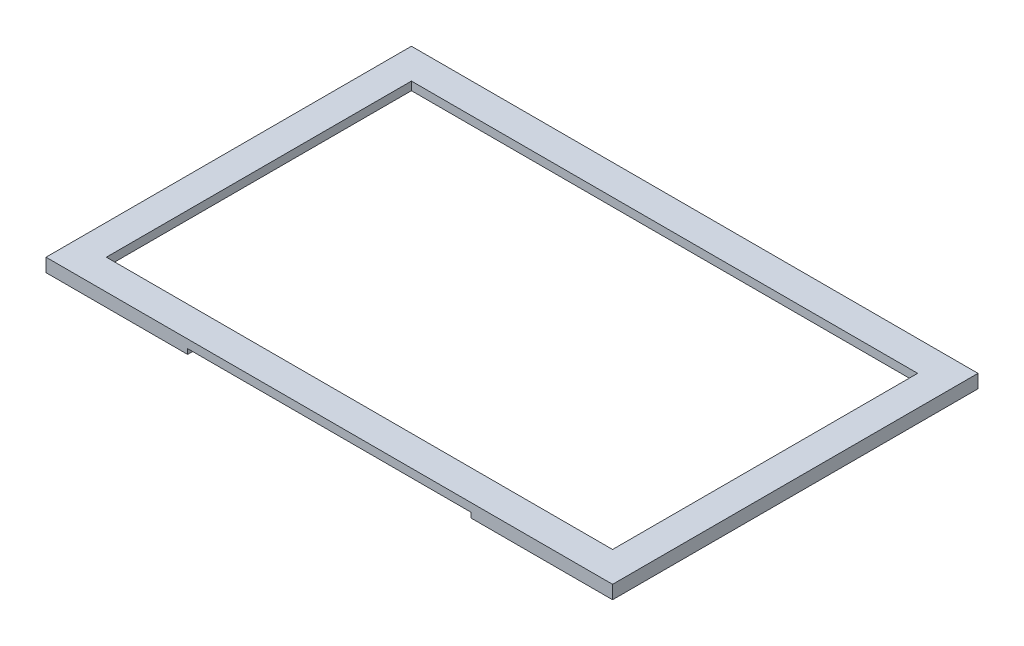
ISO-10303-21;
HEADER;
FILE_DESCRIPTION(('STEP AP214'),'2;1');
FILE_NAME('part.step','',(''),(''),'','','');
FILE_SCHEMA(('AUTOMOTIVE_DESIGN { 1 0 10303 214 1 1 1 1 }'));
ENDSEC;
DATA;
#1=APPLICATION_CONTEXT('core data for automotive mechanical design processes');
#2=APPLICATION_PROTOCOL_DEFINITION('international standard','automotive_design',2000,#1);
#3=PRODUCT_CONTEXT('',#1,'mechanical');
#4=PRODUCT('Part','Part','',(#3));
#5=PRODUCT_RELATED_PRODUCT_CATEGORY('part','',(#4));
#6=PRODUCT_DEFINITION_FORMATION('','',#4);
#7=PRODUCT_DEFINITION_CONTEXT('part definition',#1,'design');
#8=PRODUCT_DEFINITION('design','',#6,#7);
#9=PRODUCT_DEFINITION_SHAPE('','',#8);
#10=(LENGTH_UNIT() NAMED_UNIT(*) SI_UNIT(.MILLI.,.METRE.));
#11=(NAMED_UNIT(*) PLANE_ANGLE_UNIT() SI_UNIT($,.RADIAN.));
#12=(NAMED_UNIT(*) SI_UNIT($,.STERADIAN.) SOLID_ANGLE_UNIT());
#13=UNCERTAINTY_MEASURE_WITH_UNIT(LENGTH_MEASURE(1.E-05),#10,'distance_accuracy_value','');
#14=(GEOMETRIC_REPRESENTATION_CONTEXT(3) GLOBAL_UNCERTAINTY_ASSIGNED_CONTEXT((#13)) GLOBAL_UNIT_ASSIGNED_CONTEXT((#10,
#11,#12)) REPRESENTATION_CONTEXT('',''));
#15=CARTESIAN_POINT('',(0.,0.,0.));
#16=DIRECTION('',(0.,0.,1.));
#17=DIRECTION('',(1.,0.,0.));
#18=AXIS2_PLACEMENT_3D('',#15,#16,#17);
#19=CARTESIAN_POINT('',(167.,1.5,-1.99999999999999));
#20=DIRECTION('',(0.,0.,1.));
#21=DIRECTION('',(1.,0.,0.));
#22=AXIS2_PLACEMENT_3D('',#19,#20,#21);
#23=PLANE('',#22);
#24=DIRECTION('',(-1.,0.,0.));
#25=VECTOR('',#24,1.);
#26=CARTESIAN_POINT('',(167.,1.5,-1.99999999999999));
#27=LINE('',#26,#25);
#28=CARTESIAN_POINT('',(42.25,1.5,-2.));
#29=VERTEX_POINT('',#28);
#30=CARTESIAN_POINT('',(1.99999999999999,1.5,-2.00000000000001));
#31=VERTEX_POINT('',#30);
#32=EDGE_CURVE('E168',#29,#31,#27,.T.);
#33=ORIENTED_EDGE('',*,*,#32,.F.);
#34=DIRECTION('',(0.,-1.,0.));
#35=VECTOR('',#34,1.);
#36=CARTESIAN_POINT('',(42.25,0.,-2.));
#37=LINE('',#36,#35);
#38=CARTESIAN_POINT('',(42.25,0.,-2.));
#39=VERTEX_POINT('',#38);
#40=EDGE_CURVE('E55',#29,#39,#37,.T.);
#41=ORIENTED_EDGE('',*,*,#40,.T.);
#42=DIRECTION('',(-1.,0.,0.));
#43=VECTOR('',#42,1.);
#44=CARTESIAN_POINT('',(167.,0.,-1.99999999999999));
#45=LINE('',#44,#43);
#46=CARTESIAN_POINT('',(1.99999999999999,0.,-2.00000000000001));
#47=VERTEX_POINT('',#46);
#48=EDGE_CURVE('E166',#39,#47,#45,.T.);
#49=ORIENTED_EDGE('',*,*,#48,.T.);
#50=DIRECTION('',(0.,-1.,0.));
#51=VECTOR('',#50,1.);
#52=CARTESIAN_POINT('',(1.99999999999999,1.5,-2.00000000000001));
#53=LINE('',#52,#51);
#54=EDGE_CURVE('E189',#31,#47,#53,.T.);
#55=ORIENTED_EDGE('',*,*,#54,.F.);
#56=EDGE_LOOP('',(#33,#41,#49,#55));
#57=FACE_BOUND('',#56,.T.);
#58=ADVANCED_FACE('F39',(#57),#23,.F.);
#59=CARTESIAN_POINT('',(0.,0.,-109.));
#60=DIRECTION('',(-1.,0.,0.));
#61=DIRECTION('',(0.,0.,1.));
#62=AXIS2_PLACEMENT_3D('',#59,#60,#61);
#63=PLANE('',#62);
#64=DIRECTION('',(0.,-1.,0.));
#65=VECTOR('',#64,1.);
#66=CARTESIAN_POINT('',(0.,0.,0.));
#67=LINE('',#66,#65);
#68=CARTESIAN_POINT('',(0.,4.,0.));
#69=VERTEX_POINT('',#68);
#70=CARTESIAN_POINT('',(0.,0.,0.));
#71=VERTEX_POINT('',#70);
#72=EDGE_CURVE('E192',#69,#71,#67,.T.);
#73=ORIENTED_EDGE('',*,*,#72,.F.);
#74=DIRECTION('',(0.,0.,1.));
#75=VECTOR('',#74,1.);
#76=CARTESIAN_POINT('',(0.,4.,-109.));
#77=LINE('',#76,#75);
#78=CARTESIAN_POINT('',(0.,4.,-109.));
#79=VERTEX_POINT('',#78);
#80=EDGE_CURVE('E236',#79,#69,#77,.T.);
#81=ORIENTED_EDGE('',*,*,#80,.F.);
#82=DIRECTION('',(0.,-1.,0.));
#83=VECTOR('',#82,1.);
#84=CARTESIAN_POINT('',(0.,0.,-109.));
#85=LINE('',#84,#83);
#86=CARTESIAN_POINT('',(0.,0.,-109.));
#87=VERTEX_POINT('',#86);
#88=EDGE_CURVE('E204',#79,#87,#85,.T.);
#89=ORIENTED_EDGE('',*,*,#88,.T.);
#90=DIRECTION('',(0.,0.,1.));
#91=VECTOR('',#90,1.);
#92=CARTESIAN_POINT('',(0.,0.,-109.));
#93=LINE('',#92,#91);
#94=EDGE_CURVE('E221',#87,#71,#93,.T.);
#95=ORIENTED_EDGE('',*,*,#94,.T.);
#96=EDGE_LOOP('',(#73,#81,#89,#95));
#97=FACE_BOUND('',#96,.T.);
#98=ADVANCED_FACE('F41',(#97),#63,.T.);
#99=CARTESIAN_POINT('',(0.,4.,-109.));
#100=DIRECTION('',(0.,1.,0.));
#101=DIRECTION('',(0.,0.,1.));
#102=AXIS2_PLACEMENT_3D('',#99,#100,#101);
#103=PLANE('',#102);
#104=DIRECTION('',(0.,0.,1.));
#105=VECTOR('',#104,1.);
#106=CARTESIAN_POINT('',(9.00000000000001,4.,-9.));
#107=LINE('',#106,#105);
#108=CARTESIAN_POINT('',(9.00000000000001,4.,-100.));
#109=VERTEX_POINT('',#108);
#110=CARTESIAN_POINT('',(9.00000000000001,4.,-9.00000000000001));
#111=VERTEX_POINT('',#110);
#112=EDGE_CURVE('E63',#109,#111,#107,.T.);
#113=ORIENTED_EDGE('',*,*,#112,.F.);
#114=DIRECTION('',(-1.,0.,0.));
#115=VECTOR('',#114,1.);
#116=CARTESIAN_POINT('',(160.,4.,-100.));
#117=LINE('',#116,#115);
#118=CARTESIAN_POINT('',(160.,4.,-100.));
#119=VERTEX_POINT('',#118);
#120=EDGE_CURVE('E285',#119,#109,#117,.T.);
#121=ORIENTED_EDGE('',*,*,#120,.F.);
#122=DIRECTION('',(0.,0.,-1.));
#123=VECTOR('',#122,1.);
#124=CARTESIAN_POINT('',(160.,4.,-9.00000000000002));
#125=LINE('',#124,#123);
#126=CARTESIAN_POINT('',(160.,4.,-9.00000000000002));
#127=VERTEX_POINT('',#126);
#128=EDGE_CURVE('E271',#127,#119,#125,.T.);
#129=ORIENTED_EDGE('',*,*,#128,.F.);
#130=DIRECTION('',(1.,0.,0.));
#131=VECTOR('',#130,1.);
#132=CARTESIAN_POINT('',(160.,4.,-9.00000000000002));
#133=LINE('',#132,#131);
#134=EDGE_CURVE('E393',#111,#127,#133,.T.);
#135=ORIENTED_EDGE('',*,*,#134,.F.);
#136=EDGE_LOOP('',(#113,#121,#129,#135));
#137=FACE_BOUND('',#136,.T.);
#138=DIRECTION('',(-1.,0.,0.));
#139=VECTOR('',#138,1.);
#140=CARTESIAN_POINT('',(0.,4.,0.));
#141=LINE('',#140,#139);
#142=CARTESIAN_POINT('',(169.,4.,0.));
#143=VERTEX_POINT('',#142);
#144=EDGE_CURVE('E209',#143,#69,#141,.T.);
#145=ORIENTED_EDGE('',*,*,#144,.F.);
#146=DIRECTION('',(0.,0.,1.));
#147=VECTOR('',#146,1.);
#148=CARTESIAN_POINT('',(169.,4.,-109.));
#149=LINE('',#148,#147);
#150=CARTESIAN_POINT('',(169.,4.,-109.));
#151=VERTEX_POINT('',#150);
#152=EDGE_CURVE('E240',#151,#143,#149,.T.);
#153=ORIENTED_EDGE('',*,*,#152,.F.);
#154=DIRECTION('',(-1.,0.,0.));
#155=VECTOR('',#154,1.);
#156=CARTESIAN_POINT('',(0.,4.,-109.));
#157=LINE('',#156,#155);
#158=EDGE_CURVE('E217',#151,#79,#157,.T.);
#159=ORIENTED_EDGE('',*,*,#158,.T.);
#160=ORIENTED_EDGE('',*,*,#80,.T.);
#161=EDGE_LOOP('',(#145,#153,#159,#160));
#162=FACE_BOUND('',#161,.T.);
#163=ADVANCED_FACE('F341',(#137,#162),#103,.T.);
#164=CARTESIAN_POINT('',(169.,0.,-109.));
#165=DIRECTION('',(1.,0.,0.));
#166=DIRECTION('',(0.,0.,-1.));
#167=AXIS2_PLACEMENT_3D('',#164,#165,#166);
#168=PLANE('',#167);
#169=DIRECTION('',(0.,1.,0.));
#170=VECTOR('',#169,1.);
#171=CARTESIAN_POINT('',(169.,0.,0.));
#172=LINE('',#171,#170);
#173=CARTESIAN_POINT('',(169.,0.,0.));
#174=VERTEX_POINT('',#173);
#175=EDGE_CURVE('E229',#174,#143,#172,.T.);
#176=ORIENTED_EDGE('',*,*,#175,.F.);
#177=DIRECTION('',(0.,0.,1.));
#178=VECTOR('',#177,1.);
#179=CARTESIAN_POINT('',(169.,0.,-109.));
#180=LINE('',#179,#178);
#181=CARTESIAN_POINT('',(169.,0.,-109.));
#182=VERTEX_POINT('',#181);
#183=EDGE_CURVE('E243',#182,#174,#180,.T.);
#184=ORIENTED_EDGE('',*,*,#183,.F.);
#185=DIRECTION('',(0.,1.,0.));
#186=VECTOR('',#185,1.);
#187=CARTESIAN_POINT('',(169.,0.,-109.));
#188=LINE('',#187,#186);
#189=EDGE_CURVE('E213',#182,#151,#188,.T.);
#190=ORIENTED_EDGE('',*,*,#189,.T.);
#191=ORIENTED_EDGE('',*,*,#152,.T.);
#192=EDGE_LOOP('',(#176,#184,#190,#191));
#193=FACE_BOUND('',#192,.T.);
#194=ADVANCED_FACE('F402',(#193),#168,.T.);
#195=CARTESIAN_POINT('',(0.,0.,-109.));
#196=DIRECTION('',(0.,-1.,0.));
#197=DIRECTION('',(0.,0.,-1.));
#198=AXIS2_PLACEMENT_3D('',#195,#196,#197);
#199=PLANE('',#198);
#200=DIRECTION('',(0.,0.,1.));
#201=VECTOR('',#200,1.);
#202=CARTESIAN_POINT('',(42.25,0.,-2.));
#203=LINE('',#202,#201);
#204=CARTESIAN_POINT('',(42.25,0.,0.));
#205=VERTEX_POINT('',#204);
#206=EDGE_CURVE('E151',#39,#205,#203,.T.);
#207=ORIENTED_EDGE('',*,*,#206,.T.);
#208=DIRECTION('',(1.,0.,0.));
#209=VECTOR('',#208,1.);
#210=CARTESIAN_POINT('',(0.,0.,0.));
#211=LINE('',#210,#209);
#212=EDGE_CURVE('E226',#71,#205,#211,.T.);
#213=ORIENTED_EDGE('',*,*,#212,.F.);
#214=ORIENTED_EDGE('',*,*,#94,.F.);
#215=DIRECTION('',(1.,0.,0.));
#216=VECTOR('',#215,1.);
#217=CARTESIAN_POINT('',(0.,0.,-109.));
#218=LINE('',#217,#216);
#219=EDGE_CURVE('E208',#87,#182,#218,.T.);
#220=ORIENTED_EDGE('',*,*,#219,.T.);
#221=ORIENTED_EDGE('',*,*,#183,.T.);
#222=CARTESIAN_POINT('',(126.75,0.,0.));
#223=VERTEX_POINT('',#222);
#224=EDGE_CURVE('E225',#223,#174,#211,.T.);
#225=ORIENTED_EDGE('',*,*,#224,.F.);
#226=DIRECTION('',(0.,0.,1.));
#227=VECTOR('',#226,1.);
#228=CARTESIAN_POINT('',(126.75,0.,-2.));
#229=LINE('',#228,#227);
#230=CARTESIAN_POINT('',(126.75,0.,-2.));
#231=VERTEX_POINT('',#230);
#232=EDGE_CURVE('E160',#231,#223,#229,.T.);
#233=ORIENTED_EDGE('',*,*,#232,.F.);
#234=CARTESIAN_POINT('',(167.,0.,-1.99999999999999));
#235=VERTEX_POINT('',#234);
#236=EDGE_CURVE('E177',#235,#231,#45,.T.);
#237=ORIENTED_EDGE('',*,*,#236,.F.);
#238=DIRECTION('',(0.,0.,1.));
#239=VECTOR('',#238,1.);
#240=CARTESIAN_POINT('',(167.,0.,-107.));
#241=LINE('',#240,#239);
#242=CARTESIAN_POINT('',(167.,0.,-107.));
#243=VERTEX_POINT('',#242);
#244=EDGE_CURVE('E178',#243,#235,#241,.T.);
#245=ORIENTED_EDGE('',*,*,#244,.F.);
#246=DIRECTION('',(1.,0.,0.));
#247=VECTOR('',#246,1.);
#248=CARTESIAN_POINT('',(167.,0.,-107.));
#249=LINE('',#248,#247);
#250=CARTESIAN_POINT('',(1.99999999999999,0.,-107.));
#251=VERTEX_POINT('',#250);
#252=EDGE_CURVE('E185',#251,#243,#249,.T.);
#253=ORIENTED_EDGE('',*,*,#252,.F.);
#254=DIRECTION('',(0.,0.,-1.));
#255=VECTOR('',#254,1.);
#256=CARTESIAN_POINT('',(1.99999999999999,0.,-107.));
#257=LINE('',#256,#255);
#258=EDGE_CURVE('E175',#47,#251,#257,.T.);
#259=ORIENTED_EDGE('',*,*,#258,.F.);
#260=ORIENTED_EDGE('',*,*,#48,.F.);
#261=EDGE_LOOP('',(#207,#213,#214,#220,#221,#225,#233,#237,#245,#253,#259,#260));
#262=FACE_BOUND('',#261,.T.);
#263=ADVANCED_FACE('F173',(#262),#199,.T.);
#264=CARTESIAN_POINT('',(0.,0.,-109.));
#265=DIRECTION('',(0.,0.,-1.));
#266=DIRECTION('',(-1.,0.,0.));
#267=AXIS2_PLACEMENT_3D('',#264,#265,#266);
#268=PLANE('',#267);
#269=ORIENTED_EDGE('',*,*,#88,.F.);
#270=ORIENTED_EDGE('',*,*,#158,.F.);
#271=ORIENTED_EDGE('',*,*,#189,.F.);
#272=ORIENTED_EDGE('',*,*,#219,.F.);
#273=EDGE_LOOP('',(#269,#270,#271,#272));
#274=FACE_BOUND('',#273,.T.);
#275=ADVANCED_FACE('F332',(#274),#268,.T.);
#276=CARTESIAN_POINT('',(0.,0.,0.));
#277=DIRECTION('',(0.,0.,-1.));
#278=DIRECTION('',(-1.,0.,0.));
#279=AXIS2_PLACEMENT_3D('',#276,#277,#278);
#280=PLANE('',#279);
#281=ORIENTED_EDGE('',*,*,#212,.T.);
#282=DIRECTION('',(0.,-1.,0.));
#283=VECTOR('',#282,1.);
#284=CARTESIAN_POINT('',(42.25,0.,0.));
#285=LINE('',#284,#283);
#286=CARTESIAN_POINT('',(42.25,1.5,0.));
#287=VERTEX_POINT('',#286);
#288=EDGE_CURVE('E154',#287,#205,#285,.T.);
#289=ORIENTED_EDGE('',*,*,#288,.F.);
#290=DIRECTION('',(-1.,0.,0.));
#291=VECTOR('',#290,1.);
#292=CARTESIAN_POINT('',(42.25,1.5,0.));
#293=LINE('',#292,#291);
#294=CARTESIAN_POINT('',(126.75,1.5,0.));
#295=VERTEX_POINT('',#294);
#296=EDGE_CURVE('E170',#295,#287,#293,.T.);
#297=ORIENTED_EDGE('',*,*,#296,.F.);
#298=DIRECTION('',(0.,1.,0.));
#299=VECTOR('',#298,1.);
#300=CARTESIAN_POINT('',(126.75,0.,0.));
#301=LINE('',#300,#299);
#302=EDGE_CURVE('E372',#223,#295,#301,.T.);
#303=ORIENTED_EDGE('',*,*,#302,.F.);
#304=ORIENTED_EDGE('',*,*,#224,.T.);
#305=ORIENTED_EDGE('',*,*,#175,.T.);
#306=ORIENTED_EDGE('',*,*,#144,.T.);
#307=ORIENTED_EDGE('',*,*,#72,.T.);
#308=EDGE_LOOP('',(#281,#289,#297,#303,#304,#305,#306,#307));
#309=FACE_BOUND('',#308,.T.);
#310=ADVANCED_FACE('F324',(#309),#280,.F.);
#311=CARTESIAN_POINT('',(1.99999999999999,1.5,-107.));
#312=DIRECTION('',(-1.,0.,0.));
#313=DIRECTION('',(0.,0.,1.));
#314=AXIS2_PLACEMENT_3D('',#311,#312,#313);
#315=PLANE('',#314);
#316=ORIENTED_EDGE('',*,*,#258,.T.);
#317=DIRECTION('',(0.,-1.,0.));
#318=VECTOR('',#317,1.);
#319=CARTESIAN_POINT('',(1.99999999999999,1.5,-107.));
#320=LINE('',#319,#318);
#321=CARTESIAN_POINT('',(1.99999999999999,1.5,-107.));
#322=VERTEX_POINT('',#321);
#323=EDGE_CURVE('E199',#322,#251,#320,.T.);
#324=ORIENTED_EDGE('',*,*,#323,.F.);
#325=DIRECTION('',(0.,0.,-1.));
#326=VECTOR('',#325,1.);
#327=CARTESIAN_POINT('',(1.99999999999999,1.5,-107.));
#328=LINE('',#327,#326);
#329=EDGE_CURVE('E183',#31,#322,#328,.T.);
#330=ORIENTED_EDGE('',*,*,#329,.F.);
#331=ORIENTED_EDGE('',*,*,#54,.T.);
#332=EDGE_LOOP('',(#316,#324,#330,#331));
#333=FACE_BOUND('',#332,.T.);
#334=ADVANCED_FACE('F321',(#333),#315,.F.);
#335=ORIENTED_EDGE('',*,*,#236,.T.);
#336=DIRECTION('',(0.,1.,0.));
#337=VECTOR('',#336,1.);
#338=CARTESIAN_POINT('',(126.75,0.,-2.));
#339=LINE('',#338,#337);
#340=CARTESIAN_POINT('',(126.75,1.5,-2.));
#341=VERTEX_POINT('',#340);
#342=EDGE_CURVE('E161',#231,#341,#339,.T.);
#343=ORIENTED_EDGE('',*,*,#342,.T.);
#344=CARTESIAN_POINT('',(167.,1.5,-1.99999999999999));
#345=VERTEX_POINT('',#344);
#346=EDGE_CURVE('E203',#345,#341,#27,.T.);
#347=ORIENTED_EDGE('',*,*,#346,.F.);
#348=DIRECTION('',(0.,-1.,0.));
#349=VECTOR('',#348,1.);
#350=CARTESIAN_POINT('',(167.,1.5,-1.99999999999999));
#351=LINE('',#350,#349);
#352=EDGE_CURVE('E193',#345,#235,#351,.T.);
#353=ORIENTED_EDGE('',*,*,#352,.T.);
#354=EDGE_LOOP('',(#335,#343,#347,#353));
#355=FACE_BOUND('',#354,.T.);
#356=ADVANCED_FACE('F323',(#355),#23,.F.);
#357=CARTESIAN_POINT('',(167.,1.5,-107.));
#358=DIRECTION('',(1.,0.,0.));
#359=DIRECTION('',(0.,0.,-1.));
#360=AXIS2_PLACEMENT_3D('',#357,#358,#359);
#361=PLANE('',#360);
#362=ORIENTED_EDGE('',*,*,#244,.T.);
#363=ORIENTED_EDGE('',*,*,#352,.F.);
#364=DIRECTION('',(0.,0.,1.));
#365=VECTOR('',#364,1.);
#366=CARTESIAN_POINT('',(167.,1.5,-107.));
#367=LINE('',#366,#365);
#368=CARTESIAN_POINT('',(167.,1.5,-107.));
#369=VERTEX_POINT('',#368);
#370=EDGE_CURVE('E299',#369,#345,#367,.T.);
#371=ORIENTED_EDGE('',*,*,#370,.F.);
#372=DIRECTION('',(0.,-1.,0.));
#373=VECTOR('',#372,1.);
#374=CARTESIAN_POINT('',(167.,1.5,-107.));
#375=LINE('',#374,#373);
#376=EDGE_CURVE('E196',#369,#243,#375,.T.);
#377=ORIENTED_EDGE('',*,*,#376,.T.);
#378=EDGE_LOOP('',(#362,#363,#371,#377));
#379=FACE_BOUND('',#378,.T.);
#380=ADVANCED_FACE('F317',(#379),#361,.F.);
#381=CARTESIAN_POINT('',(167.,1.5,-107.));
#382=DIRECTION('',(0.,0.,-1.));
#383=DIRECTION('',(-1.,0.,0.));
#384=AXIS2_PLACEMENT_3D('',#381,#382,#383);
#385=PLANE('',#384);
#386=ORIENTED_EDGE('',*,*,#252,.T.);
#387=ORIENTED_EDGE('',*,*,#376,.F.);
#388=DIRECTION('',(1.,0.,0.));
#389=VECTOR('',#388,1.);
#390=CARTESIAN_POINT('',(167.,1.5,-107.));
#391=LINE('',#390,#389);
#392=EDGE_CURVE('E295',#322,#369,#391,.T.);
#393=ORIENTED_EDGE('',*,*,#392,.F.);
#394=ORIENTED_EDGE('',*,*,#323,.T.);
#395=EDGE_LOOP('',(#386,#387,#393,#394));
#396=FACE_BOUND('',#395,.T.);
#397=ADVANCED_FACE('F311',(#396),#385,.F.);
#398=CARTESIAN_POINT('',(0.,1.5,0.));
#399=DIRECTION('',(0.,-1.,0.));
#400=DIRECTION('',(0.,0.,-1.));
#401=AXIS2_PLACEMENT_3D('',#398,#399,#400);
#402=PLANE('',#401);
#403=DIRECTION('',(0.,0.,-1.));
#404=VECTOR('',#403,1.);
#405=CARTESIAN_POINT('',(9.00000000000001,1.5,0.));
#406=LINE('',#405,#404);
#407=CARTESIAN_POINT('',(9.00000000000001,1.5,-9.));
#408=VERTEX_POINT('',#407);
#409=CARTESIAN_POINT('',(9.00000000000001,1.5,-100.));
#410=VERTEX_POINT('',#409);
#411=EDGE_CURVE('E11',#408,#410,#406,.T.);
#412=ORIENTED_EDGE('',*,*,#411,.F.);
#413=DIRECTION('',(-1.,0.,0.));
#414=VECTOR('',#413,1.);
#415=CARTESIAN_POINT('',(0.,1.5,-9.));
#416=LINE('',#415,#414);
#417=CARTESIAN_POINT('',(160.,1.5,-9.00000000000002));
#418=VERTEX_POINT('',#417);
#419=EDGE_CURVE('E239',#418,#408,#416,.T.);
#420=ORIENTED_EDGE('',*,*,#419,.F.);
#421=DIRECTION('',(0.,0.,1.));
#422=VECTOR('',#421,1.);
#423=CARTESIAN_POINT('',(160.,1.5,0.));
#424=LINE('',#423,#422);
#425=CARTESIAN_POINT('',(160.,1.5,-100.));
#426=VERTEX_POINT('',#425);
#427=EDGE_CURVE('E251',#426,#418,#424,.T.);
#428=ORIENTED_EDGE('',*,*,#427,.F.);
#429=DIRECTION('',(1.,0.,0.));
#430=VECTOR('',#429,1.);
#431=CARTESIAN_POINT('',(0.,1.5,-100.));
#432=LINE('',#431,#430);
#433=EDGE_CURVE('E48',#410,#426,#432,.T.);
#434=ORIENTED_EDGE('',*,*,#433,.F.);
#435=EDGE_LOOP('',(#412,#420,#428,#434));
#436=FACE_BOUND('',#435,.T.);
#437=ORIENTED_EDGE('',*,*,#329,.T.);
#438=ORIENTED_EDGE('',*,*,#392,.T.);
#439=ORIENTED_EDGE('',*,*,#370,.T.);
#440=ORIENTED_EDGE('',*,*,#346,.T.);
#441=DIRECTION('',(0.,0.,1.));
#442=VECTOR('',#441,1.);
#443=CARTESIAN_POINT('',(126.75,1.5,-2.));
#444=LINE('',#443,#442);
#445=EDGE_CURVE('E374',#341,#295,#444,.T.);
#446=ORIENTED_EDGE('',*,*,#445,.T.);
#447=ORIENTED_EDGE('',*,*,#296,.T.);
#448=DIRECTION('',(0.,0.,1.));
#449=VECTOR('',#448,1.);
#450=CARTESIAN_POINT('',(42.25,1.5,-2.));
#451=LINE('',#450,#449);
#452=EDGE_CURVE('E384',#29,#287,#451,.T.);
#453=ORIENTED_EDGE('',*,*,#452,.F.);
#454=ORIENTED_EDGE('',*,*,#32,.T.);
#455=EDGE_LOOP('',(#437,#438,#439,#440,#446,#447,#453,#454));
#456=FACE_BOUND('',#455,.T.);
#457=ADVANCED_FACE('F276',(#436,#456),#402,.T.);
#458=CARTESIAN_POINT('',(9.00000000000001,-1.,-9.));
#459=DIRECTION('',(-1.,0.,0.));
#460=DIRECTION('',(0.,-1.,0.));
#461=AXIS2_PLACEMENT_3D('',#458,#459,#460);
#462=PLANE('',#461);
#463=ORIENTED_EDGE('',*,*,#411,.T.);
#464=DIRECTION('',(0.,1.,0.));
#465=VECTOR('',#464,1.);
#466=CARTESIAN_POINT('',(9.00000000000001,-1.,-100.));
#467=LINE('',#466,#465);
#468=EDGE_CURVE('E263',#410,#109,#467,.T.);
#469=ORIENTED_EDGE('',*,*,#468,.T.);
#470=ORIENTED_EDGE('',*,*,#112,.T.);
#471=DIRECTION('',(0.,1.,0.));
#472=VECTOR('',#471,1.);
#473=CARTESIAN_POINT('',(9.00000000000001,-1.,-9.));
#474=LINE('',#473,#472);
#475=EDGE_CURVE('E281',#408,#111,#474,.T.);
#476=ORIENTED_EDGE('',*,*,#475,.F.);
#477=EDGE_LOOP('',(#463,#469,#470,#476));
#478=FACE_BOUND('',#477,.T.);
#479=ADVANCED_FACE('F283',(#478),#462,.F.);
#480=CARTESIAN_POINT('',(160.,-1.,-100.));
#481=DIRECTION('',(0.,0.,-1.));
#482=DIRECTION('',(-1.,0.,0.));
#483=AXIS2_PLACEMENT_3D('',#480,#481,#482);
#484=PLANE('',#483);
#485=ORIENTED_EDGE('',*,*,#433,.T.);
#486=DIRECTION('',(0.,1.,0.));
#487=VECTOR('',#486,1.);
#488=CARTESIAN_POINT('',(160.,-1.,-100.));
#489=LINE('',#488,#487);
#490=EDGE_CURVE('E261',#426,#119,#489,.T.);
#491=ORIENTED_EDGE('',*,*,#490,.T.);
#492=ORIENTED_EDGE('',*,*,#120,.T.);
#493=ORIENTED_EDGE('',*,*,#468,.F.);
#494=EDGE_LOOP('',(#485,#491,#492,#493));
#495=FACE_BOUND('',#494,.T.);
#496=ADVANCED_FACE('F259',(#495),#484,.F.);
#497=CARTESIAN_POINT('',(160.,-1.,-9.00000000000002));
#498=DIRECTION('',(1.,0.,0.));
#499=DIRECTION('',(0.,1.,0.));
#500=AXIS2_PLACEMENT_3D('',#497,#498,#499);
#501=PLANE('',#500);
#502=ORIENTED_EDGE('',*,*,#427,.T.);
#503=DIRECTION('',(0.,1.,0.));
#504=VECTOR('',#503,1.);
#505=CARTESIAN_POINT('',(160.,-1.,-9.00000000000002));
#506=LINE('',#505,#504);
#507=EDGE_CURVE('E274',#418,#127,#506,.T.);
#508=ORIENTED_EDGE('',*,*,#507,.T.);
#509=ORIENTED_EDGE('',*,*,#128,.T.);
#510=ORIENTED_EDGE('',*,*,#490,.F.);
#511=EDGE_LOOP('',(#502,#508,#509,#510));
#512=FACE_BOUND('',#511,.T.);
#513=ADVANCED_FACE('F268',(#512),#501,.F.);
#514=CARTESIAN_POINT('',(160.,-1.,-9.00000000000002));
#515=DIRECTION('',(0.,0.,1.));
#516=DIRECTION('',(1.,0.,0.));
#517=AXIS2_PLACEMENT_3D('',#514,#515,#516);
#518=PLANE('',#517);
#519=ORIENTED_EDGE('',*,*,#419,.T.);
#520=ORIENTED_EDGE('',*,*,#475,.T.);
#521=ORIENTED_EDGE('',*,*,#134,.T.);
#522=ORIENTED_EDGE('',*,*,#507,.F.);
#523=EDGE_LOOP('',(#519,#520,#521,#522));
#524=FACE_BOUND('',#523,.T.);
#525=ADVANCED_FACE('F279',(#524),#518,.F.);
#526=CARTESIAN_POINT('',(42.25,0.,-2.));
#527=DIRECTION('',(-1.,0.,0.));
#528=DIRECTION('',(0.,0.,1.));
#529=AXIS2_PLACEMENT_3D('',#526,#527,#528);
#530=PLANE('',#529);
#531=ORIENTED_EDGE('',*,*,#288,.T.);
#532=ORIENTED_EDGE('',*,*,#206,.F.);
#533=ORIENTED_EDGE('',*,*,#40,.F.);
#534=ORIENTED_EDGE('',*,*,#452,.T.);
#535=EDGE_LOOP('',(#531,#532,#533,#534));
#536=FACE_BOUND('',#535,.T.);
#537=ADVANCED_FACE('F152',(#536),#530,.F.);
#538=CARTESIAN_POINT('',(126.75,0.,-2.));
#539=DIRECTION('',(1.,0.,0.));
#540=DIRECTION('',(0.,0.,-1.));
#541=AXIS2_PLACEMENT_3D('',#538,#539,#540);
#542=PLANE('',#541);
#543=ORIENTED_EDGE('',*,*,#302,.T.);
#544=ORIENTED_EDGE('',*,*,#445,.F.);
#545=ORIENTED_EDGE('',*,*,#342,.F.);
#546=ORIENTED_EDGE('',*,*,#232,.T.);
#547=EDGE_LOOP('',(#543,#544,#545,#546));
#548=FACE_BOUND('',#547,.T.);
#549=ADVANCED_FACE('F365',(#548),#542,.F.);
#550=CLOSED_SHELL('',(#58,#98,#163,#194,#263,#275,#310,#334,#356,#380,#397,#457,#479,#496,#513,
#525,#537,#549));
#551=MANIFOLD_SOLID_BREP('B2',#550);
#552=ADVANCED_BREP_SHAPE_REPRESENTATION('',(#18,#551),#14);
#553=SHAPE_DEFINITION_REPRESENTATION(#9,#552);
ENDSEC;
END-ISO-10303-21;
